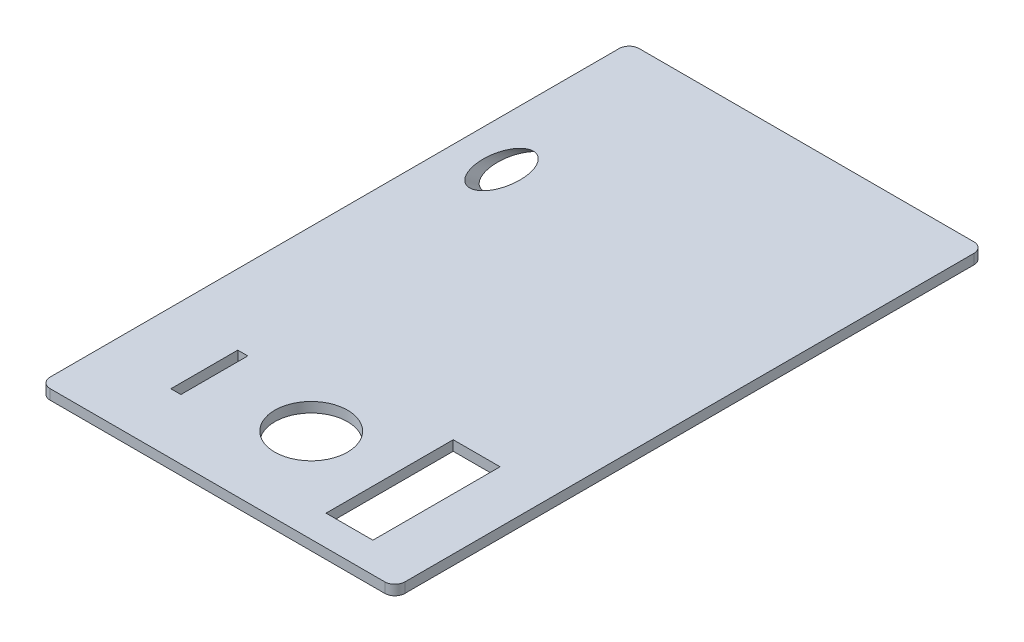
ISO-10303-21;
HEADER;
FILE_DESCRIPTION(('STEP AP214'),'2;1');
FILE_NAME('part.step','',(''),(''),'','','');
FILE_SCHEMA(('AUTOMOTIVE_DESIGN { 1 0 10303 214 1 1 1 1 }'));
ENDSEC;
DATA;
#1=APPLICATION_CONTEXT('core data for automotive mechanical design processes');
#2=APPLICATION_PROTOCOL_DEFINITION('international standard','automotive_design',2000,#1);
#3=PRODUCT_CONTEXT('',#1,'mechanical');
#4=PRODUCT('Part','Part','',(#3));
#5=PRODUCT_RELATED_PRODUCT_CATEGORY('part','',(#4));
#6=PRODUCT_DEFINITION_FORMATION('','',#4);
#7=PRODUCT_DEFINITION_CONTEXT('part definition',#1,'design');
#8=PRODUCT_DEFINITION('design','',#6,#7);
#9=PRODUCT_DEFINITION_SHAPE('','',#8);
#10=(LENGTH_UNIT() NAMED_UNIT(*) SI_UNIT(.MILLI.,.METRE.));
#11=(NAMED_UNIT(*) PLANE_ANGLE_UNIT() SI_UNIT($,.RADIAN.));
#12=(NAMED_UNIT(*) SI_UNIT($,.STERADIAN.) SOLID_ANGLE_UNIT());
#13=UNCERTAINTY_MEASURE_WITH_UNIT(LENGTH_MEASURE(1.E-05),#10,'distance_accuracy_value','');
#14=(GEOMETRIC_REPRESENTATION_CONTEXT(3) GLOBAL_UNCERTAINTY_ASSIGNED_CONTEXT((#13)) GLOBAL_UNIT_ASSIGNED_CONTEXT((#10,
#11,#12)) REPRESENTATION_CONTEXT('',''));
#15=CARTESIAN_POINT('',(0.,0.,0.));
#16=DIRECTION('',(0.,0.,1.));
#17=DIRECTION('',(1.,0.,0.));
#18=AXIS2_PLACEMENT_3D('',#15,#16,#17);
#19=CARTESIAN_POINT('',(53.,70.,88.));
#20=DIRECTION('',(0.,0.,-1.));
#21=DIRECTION('',(-1.,0.,0.));
#22=AXIS2_PLACEMENT_3D('',#19,#20,#21);
#23=PLANE('',#22);
#24=DIRECTION('',(1.,0.,0.));
#25=VECTOR('',#24,1.);
#26=CARTESIAN_POINT('',(50.,0.,88.));
#27=LINE('',#26,#25);
#28=CARTESIAN_POINT('',(-50.,0.,88.));
#29=VERTEX_POINT('',#28);
#30=CARTESIAN_POINT('',(50.,0.,88.));
#31=VERTEX_POINT('',#30);
#32=EDGE_CURVE('E347',#29,#31,#27,.T.);
#33=ORIENTED_EDGE('',*,*,#32,.F.);
#34=DIRECTION('',(0.,1.,0.));
#35=VECTOR('',#34,1.);
#36=CARTESIAN_POINT('',(-50.,70.,88.));
#37=LINE('',#36,#35);
#38=CARTESIAN_POINT('',(-50.,-3.,88.));
#39=VERTEX_POINT('',#38);
#40=EDGE_CURVE('E188',#29,#39,#37,.F.);
#41=ORIENTED_EDGE('',*,*,#40,.T.);
#42=DIRECTION('',(-1.,0.,0.));
#43=VECTOR('',#42,1.);
#44=CARTESIAN_POINT('',(53.,-3.,88.));
#45=LINE('',#44,#43);
#46=CARTESIAN_POINT('',(50.,-3.,88.));
#47=VERTEX_POINT('',#46);
#48=EDGE_CURVE('E234',#47,#39,#45,.T.);
#49=ORIENTED_EDGE('',*,*,#48,.F.);
#50=DIRECTION('',(0.,1.,0.));
#51=VECTOR('',#50,1.);
#52=CARTESIAN_POINT('',(50.,70.,88.));
#53=LINE('',#52,#51);
#54=EDGE_CURVE('E181',#47,#31,#53,.T.);
#55=ORIENTED_EDGE('',*,*,#54,.T.);
#56=EDGE_LOOP('',(#33,#41,#49,#55));
#57=FACE_BOUND('',#56,.T.);
#58=ADVANCED_FACE('F38',(#57),#23,.F.);
#59=CARTESIAN_POINT('',(53.,70.,-88.));
#60=DIRECTION('',(0.,0.,1.));
#61=DIRECTION('',(1.,0.,0.));
#62=AXIS2_PLACEMENT_3D('',#59,#60,#61);
#63=PLANE('',#62);
#64=DIRECTION('',(-1.,0.,0.));
#65=VECTOR('',#64,1.);
#66=CARTESIAN_POINT('',(50.,0.,-88.));
#67=LINE('',#66,#65);
#68=CARTESIAN_POINT('',(50.,0.,-88.));
#69=VERTEX_POINT('',#68);
#70=CARTESIAN_POINT('',(-50.,0.,-88.));
#71=VERTEX_POINT('',#70);
#72=EDGE_CURVE('E344',#69,#71,#67,.T.);
#73=ORIENTED_EDGE('',*,*,#72,.F.);
#74=DIRECTION('',(0.,1.,0.));
#75=VECTOR('',#74,1.);
#76=CARTESIAN_POINT('',(50.,70.,-88.));
#77=LINE('',#76,#75);
#78=CARTESIAN_POINT('',(50.,-3.,-88.));
#79=VERTEX_POINT('',#78);
#80=EDGE_CURVE('E171',#69,#79,#77,.F.);
#81=ORIENTED_EDGE('',*,*,#80,.T.);
#82=DIRECTION('',(1.,0.,0.));
#83=VECTOR('',#82,1.);
#84=CARTESIAN_POINT('',(53.,-3.,-88.));
#85=LINE('',#84,#83);
#86=CARTESIAN_POINT('',(-50.,-3.,-88.));
#87=VERTEX_POINT('',#86);
#88=EDGE_CURVE('E240',#87,#79,#85,.T.);
#89=ORIENTED_EDGE('',*,*,#88,.F.);
#90=DIRECTION('',(0.,1.,0.));
#91=VECTOR('',#90,1.);
#92=CARTESIAN_POINT('',(-50.,70.,-88.));
#93=LINE('',#92,#91);
#94=EDGE_CURVE('E203',#87,#71,#93,.T.);
#95=ORIENTED_EDGE('',*,*,#94,.T.);
#96=EDGE_LOOP('',(#73,#81,#89,#95));
#97=FACE_BOUND('',#96,.T.);
#98=ADVANCED_FACE('F361',(#97),#63,.F.);
#99=CARTESIAN_POINT('',(-53.,70.,-88.));
#100=DIRECTION('',(1.,0.,0.));
#101=DIRECTION('',(0.,0.,-1.));
#102=AXIS2_PLACEMENT_3D('',#99,#100,#101);
#103=PLANE('',#102);
#104=DIRECTION('',(0.,1.,0.));
#105=VECTOR('',#104,1.);
#106=CARTESIAN_POINT('',(-53.,70.,85.));
#107=LINE('',#106,#105);
#108=CARTESIAN_POINT('',(-53.,-3.,85.));
#109=VERTEX_POINT('',#108);
#110=CARTESIAN_POINT('',(-53.,0.,85.));
#111=VERTEX_POINT('',#110);
#112=EDGE_CURVE('E48',#109,#111,#107,.T.);
#113=ORIENTED_EDGE('',*,*,#112,.T.);
#114=DIRECTION('',(0.,0.,1.));
#115=VECTOR('',#114,1.);
#116=CARTESIAN_POINT('',(-53.,0.,-85.));
#117=LINE('',#116,#115);
#118=CARTESIAN_POINT('',(-53.,0.,-85.));
#119=VERTEX_POINT('',#118);
#120=EDGE_CURVE('E163',#119,#111,#117,.T.);
#121=ORIENTED_EDGE('',*,*,#120,.F.);
#122=DIRECTION('',(0.,1.,0.));
#123=VECTOR('',#122,1.);
#124=CARTESIAN_POINT('',(-53.,70.,-85.));
#125=LINE('',#124,#123);
#126=CARTESIAN_POINT('',(-53.,-3.,-85.));
#127=VERTEX_POINT('',#126);
#128=EDGE_CURVE('E11',#119,#127,#125,.F.);
#129=ORIENTED_EDGE('',*,*,#128,.T.);
#130=DIRECTION('',(0.,0.,-1.));
#131=VECTOR('',#130,1.);
#132=CARTESIAN_POINT('',(-53.,-3.,88.));
#133=LINE('',#132,#131);
#134=EDGE_CURVE('E218',#109,#127,#133,.T.);
#135=ORIENTED_EDGE('',*,*,#134,.F.);
#136=EDGE_LOOP('',(#113,#121,#129,#135));
#137=FACE_BOUND('',#136,.T.);
#138=ADVANCED_FACE('F215',(#137),#103,.F.);
#139=CARTESIAN_POINT('',(53.,70.,-88.));
#140=DIRECTION('',(-1.,0.,0.));
#141=DIRECTION('',(0.,0.,1.));
#142=AXIS2_PLACEMENT_3D('',#139,#140,#141);
#143=PLANE('',#142);
#144=DIRECTION('',(0.,1.,0.));
#145=VECTOR('',#144,1.);
#146=CARTESIAN_POINT('',(53.,70.,-85.));
#147=LINE('',#146,#145);
#148=CARTESIAN_POINT('',(53.,-3.,-85.));
#149=VERTEX_POINT('',#148);
#150=CARTESIAN_POINT('',(53.,0.,-85.));
#151=VERTEX_POINT('',#150);
#152=EDGE_CURVE('E170',#149,#151,#147,.T.);
#153=ORIENTED_EDGE('',*,*,#152,.T.);
#154=DIRECTION('',(0.,0.,-1.));
#155=VECTOR('',#154,1.);
#156=CARTESIAN_POINT('',(53.,0.,-85.));
#157=LINE('',#156,#155);
#158=CARTESIAN_POINT('',(53.,0.,85.));
#159=VERTEX_POINT('',#158);
#160=EDGE_CURVE('E151',#159,#151,#157,.T.);
#161=ORIENTED_EDGE('',*,*,#160,.F.);
#162=DIRECTION('',(0.,1.,0.));
#163=VECTOR('',#162,1.);
#164=CARTESIAN_POINT('',(53.,70.,85.));
#165=LINE('',#164,#163);
#166=CARTESIAN_POINT('',(53.,-3.,85.));
#167=VERTEX_POINT('',#166);
#168=EDGE_CURVE('E180',#159,#167,#165,.F.);
#169=ORIENTED_EDGE('',*,*,#168,.T.);
#170=DIRECTION('',(0.,0.,1.));
#171=VECTOR('',#170,1.);
#172=CARTESIAN_POINT('',(53.,-3.,88.));
#173=LINE('',#172,#171);
#174=EDGE_CURVE('E178',#149,#167,#173,.T.);
#175=ORIENTED_EDGE('',*,*,#174,.F.);
#176=EDGE_LOOP('',(#153,#161,#169,#175));
#177=FACE_BOUND('',#176,.T.);
#178=ADVANCED_FACE('F176',(#177),#143,.F.);
#179=CARTESIAN_POINT('',(0.,0.,0.));
#180=DIRECTION('',(0.,1.,0.));
#181=DIRECTION('',(0.,0.,1.));
#182=AXIS2_PLACEMENT_3D('',#179,#180,#181);
#183=PLANE('',#182);
#184=CARTESIAN_POINT('',(-50.,0.,-85.));
#185=DIRECTION('',(0.,-1.,0.));
#186=DIRECTION('',(0.,0.,-1.));
#187=AXIS2_PLACEMENT_3D('',#184,#185,#186);
#188=CIRCLE('',#187,3.);
#189=EDGE_CURVE('E173',#119,#71,#188,.T.);
#190=ORIENTED_EDGE('',*,*,#189,.F.);
#191=ORIENTED_EDGE('',*,*,#120,.T.);
#192=CARTESIAN_POINT('',(-50.,0.,85.));
#193=DIRECTION('',(0.,-1.,0.));
#194=DIRECTION('',(0.,0.,-1.));
#195=AXIS2_PLACEMENT_3D('',#192,#193,#194);
#196=CIRCLE('',#195,3.);
#197=EDGE_CURVE('E223',#29,#111,#196,.T.);
#198=ORIENTED_EDGE('',*,*,#197,.F.);
#199=ORIENTED_EDGE('',*,*,#32,.T.);
#200=CARTESIAN_POINT('',(50.,0.,85.));
#201=DIRECTION('',(0.,-1.,0.));
#202=DIRECTION('',(0.,0.,-1.));
#203=AXIS2_PLACEMENT_3D('',#200,#201,#202);
#204=CIRCLE('',#203,3.);
#205=EDGE_CURVE('E158',#159,#31,#204,.T.);
#206=ORIENTED_EDGE('',*,*,#205,.F.);
#207=ORIENTED_EDGE('',*,*,#160,.T.);
#208=CARTESIAN_POINT('',(50.,0.,-85.));
#209=DIRECTION('',(0.,-1.,0.));
#210=DIRECTION('',(0.,0.,-1.));
#211=AXIS2_PLACEMENT_3D('',#208,#209,#210);
#212=CIRCLE('',#211,3.);
#213=EDGE_CURVE('E155',#69,#151,#212,.T.);
#214=ORIENTED_EDGE('',*,*,#213,.F.);
#215=ORIENTED_EDGE('',*,*,#72,.T.);
#216=EDGE_LOOP('',(#190,#191,#198,#199,#206,#207,#214,#215));
#217=FACE_BOUND('',#216,.T.);
#218=CARTESIAN_POINT('',(-39.2636636390506,0.,-36.1311043412954));
#219=DIRECTION('',(0.,1.,0.));
#220=DIRECTION('',(0.,0.,1.));
#221=AXIS2_PLACEMENT_3D('',#218,#219,#220);
#222=ELLIPSE('',#221,9.52340377640063,5.46239999999998);
#223=CARTESIAN_POINT('',(-39.2636636390506,0.,-26.6077005648948));
#224=VERTEX_POINT('',#223);
#225=EDGE_CURVE('E42',#224,#224,#222,.T.);
#226=ORIENTED_EDGE('',*,*,#225,.F.);
#227=EDGE_LOOP('',(#226));
#228=FACE_BOUND('',#227,.T.);
#229=DIRECTION('',(0.,0.,1.));
#230=VECTOR('',#229,1.);
#231=CARTESIAN_POINT('',(-31.9347532475003,0.,50.));
#232=LINE('',#231,#230);
#233=CARTESIAN_POINT('',(-31.9347532475003,0.,50.));
#234=VERTEX_POINT('',#233);
#235=CARTESIAN_POINT('',(-31.9347532475003,0.,70.));
#236=VERTEX_POINT('',#235);
#237=EDGE_CURVE('E55',#234,#236,#232,.T.);
#238=ORIENTED_EDGE('',*,*,#237,.F.);
#239=DIRECTION('',(-1.,0.,0.));
#240=VECTOR('',#239,1.);
#241=CARTESIAN_POINT('',(-28.9347532475003,0.,50.));
#242=LINE('',#241,#240);
#243=CARTESIAN_POINT('',(-28.9347532475003,0.,50.));
#244=VERTEX_POINT('',#243);
#245=EDGE_CURVE('E311',#244,#234,#242,.T.);
#246=ORIENTED_EDGE('',*,*,#245,.F.);
#247=DIRECTION('',(0.,0.,-1.));
#248=VECTOR('',#247,1.);
#249=CARTESIAN_POINT('',(-28.9347532475003,0.,50.));
#250=LINE('',#249,#248);
#251=CARTESIAN_POINT('',(-28.9347532475003,0.,70.));
#252=VERTEX_POINT('',#251);
#253=EDGE_CURVE('E316',#252,#244,#250,.T.);
#254=ORIENTED_EDGE('',*,*,#253,.F.);
#255=DIRECTION('',(1.,0.,0.));
#256=VECTOR('',#255,1.);
#257=CARTESIAN_POINT('',(-28.9347532475003,0.,70.));
#258=LINE('',#257,#256);
#259=EDGE_CURVE('E320',#236,#252,#258,.T.);
#260=ORIENTED_EDGE('',*,*,#259,.F.);
#261=EDGE_LOOP('',(#238,#246,#254,#260));
#262=FACE_BOUND('',#261,.T.);
#263=DIRECTION('',(0.,0.,-1.));
#264=VECTOR('',#263,1.);
#265=CARTESIAN_POINT('',(37.4347532475004,0.,41.));
#266=LINE('',#265,#264);
#267=CARTESIAN_POINT('',(37.4347532475004,0.,79.));
#268=VERTEX_POINT('',#267);
#269=CARTESIAN_POINT('',(37.4347532475004,0.,41.));
#270=VERTEX_POINT('',#269);
#271=EDGE_CURVE('E281',#268,#270,#266,.T.);
#272=ORIENTED_EDGE('',*,*,#271,.F.);
#273=DIRECTION('',(1.,0.,0.));
#274=VECTOR('',#273,1.);
#275=CARTESIAN_POINT('',(23.4347532475004,0.,79.));
#276=LINE('',#275,#274);
#277=CARTESIAN_POINT('',(23.4347532475004,0.,79.));
#278=VERTEX_POINT('',#277);
#279=EDGE_CURVE('E268',#278,#268,#276,.T.);
#280=ORIENTED_EDGE('',*,*,#279,.F.);
#281=DIRECTION('',(0.,0.,1.));
#282=VECTOR('',#281,1.);
#283=CARTESIAN_POINT('',(23.4347532475004,0.,41.));
#284=LINE('',#283,#282);
#285=CARTESIAN_POINT('',(23.4347532475004,0.,41.));
#286=VERTEX_POINT('',#285);
#287=EDGE_CURVE('E273',#286,#278,#284,.T.);
#288=ORIENTED_EDGE('',*,*,#287,.F.);
#289=DIRECTION('',(-1.,0.,0.));
#290=VECTOR('',#289,1.);
#291=CARTESIAN_POINT('',(23.4347532475004,0.,41.));
#292=LINE('',#291,#290);
#293=EDGE_CURVE('E277',#270,#286,#292,.T.);
#294=ORIENTED_EDGE('',*,*,#293,.F.);
#295=EDGE_LOOP('',(#272,#280,#288,#294));
#296=FACE_BOUND('',#295,.T.);
#297=CARTESIAN_POINT('',(0.,0.,60.));
#298=DIRECTION('',(0.,1.,0.));
#299=DIRECTION('',(0.,0.,1.));
#300=AXIS2_PLACEMENT_3D('',#297,#298,#299);
#301=CIRCLE('',#300,10.8695064950007);
#302=CARTESIAN_POINT('',(0.,0.,70.8695064950007));
#303=VERTEX_POINT('',#302);
#304=EDGE_CURVE('E247',#303,#303,#301,.T.);
#305=ORIENTED_EDGE('',*,*,#304,.F.);
#306=EDGE_LOOP('',(#305));
#307=FACE_BOUND('',#306,.T.);
#308=ADVANCED_FACE('F153',(#217,#228,#262,#296,#307),#183,.T.);
#309=CARTESIAN_POINT('',(0.,-3.,0.));
#310=DIRECTION('',(0.,1.,0.));
#311=DIRECTION('',(0.,0.,1.));
#312=AXIS2_PLACEMENT_3D('',#309,#310,#311);
#313=PLANE('',#312);
#314=CARTESIAN_POINT('',(-39.2636636390506,-3.,-40.4155483615218));
#315=DIRECTION('',(0.,1.,0.));
#316=DIRECTION('',(0.,0.,1.));
#317=AXIS2_PLACEMENT_3D('',#314,#315,#316);
#318=ELLIPSE('',#317,9.52340377640063,5.46239999999998);
#319=CARTESIAN_POINT('',(-39.2636636390506,-3.,-30.8921445851211));
#320=VERTEX_POINT('',#319);
#321=EDGE_CURVE('E326',#320,#320,#318,.T.);
#322=ORIENTED_EDGE('',*,*,#321,.T.);
#323=EDGE_LOOP('',(#322));
#324=FACE_BOUND('',#323,.T.);
#325=DIRECTION('',(-1.,0.,0.));
#326=VECTOR('',#325,1.);
#327=CARTESIAN_POINT('',(-28.9347532475003,-3.,50.));
#328=LINE('',#327,#326);
#329=CARTESIAN_POINT('',(-28.9347532475003,-3.,50.));
#330=VERTEX_POINT('',#329);
#331=CARTESIAN_POINT('',(-31.9347532475003,-3.,50.));
#332=VERTEX_POINT('',#331);
#333=EDGE_CURVE('E303',#330,#332,#328,.T.);
#334=ORIENTED_EDGE('',*,*,#333,.T.);
#335=DIRECTION('',(0.,0.,1.));
#336=VECTOR('',#335,1.);
#337=CARTESIAN_POINT('',(-31.9347532475003,-3.,50.));
#338=LINE('',#337,#336);
#339=CARTESIAN_POINT('',(-31.9347532475003,-3.,70.));
#340=VERTEX_POINT('',#339);
#341=EDGE_CURVE('E315',#332,#340,#338,.T.);
#342=ORIENTED_EDGE('',*,*,#341,.T.);
#343=DIRECTION('',(1.,0.,0.));
#344=VECTOR('',#343,1.);
#345=CARTESIAN_POINT('',(-28.9347532475003,-3.,70.));
#346=LINE('',#345,#344);
#347=CARTESIAN_POINT('',(-28.9347532475003,-3.,70.));
#348=VERTEX_POINT('',#347);
#349=EDGE_CURVE('E332',#340,#348,#346,.T.);
#350=ORIENTED_EDGE('',*,*,#349,.T.);
#351=DIRECTION('',(0.,0.,-1.));
#352=VECTOR('',#351,1.);
#353=CARTESIAN_POINT('',(-28.9347532475003,-3.,50.));
#354=LINE('',#353,#352);
#355=EDGE_CURVE('E63',#348,#330,#354,.T.);
#356=ORIENTED_EDGE('',*,*,#355,.T.);
#357=EDGE_LOOP('',(#334,#342,#350,#356));
#358=FACE_BOUND('',#357,.T.);
#359=DIRECTION('',(1.,0.,0.));
#360=VECTOR('',#359,1.);
#361=CARTESIAN_POINT('',(23.4347532475004,-3.,79.));
#362=LINE('',#361,#360);
#363=CARTESIAN_POINT('',(23.4347532475004,-3.,79.));
#364=VERTEX_POINT('',#363);
#365=CARTESIAN_POINT('',(37.4347532475004,-3.,79.));
#366=VERTEX_POINT('',#365);
#367=EDGE_CURVE('E260',#364,#366,#362,.T.);
#368=ORIENTED_EDGE('',*,*,#367,.T.);
#369=DIRECTION('',(0.,0.,-1.));
#370=VECTOR('',#369,1.);
#371=CARTESIAN_POINT('',(37.4347532475004,-3.,41.));
#372=LINE('',#371,#370);
#373=CARTESIAN_POINT('',(37.4347532475004,-3.,41.));
#374=VERTEX_POINT('',#373);
#375=EDGE_CURVE('E272',#366,#374,#372,.T.);
#376=ORIENTED_EDGE('',*,*,#375,.T.);
#377=DIRECTION('',(-1.,0.,0.));
#378=VECTOR('',#377,1.);
#379=CARTESIAN_POINT('',(23.4347532475004,-3.,41.));
#380=LINE('',#379,#378);
#381=CARTESIAN_POINT('',(23.4347532475004,-3.,41.));
#382=VERTEX_POINT('',#381);
#383=EDGE_CURVE('E292',#374,#382,#380,.T.);
#384=ORIENTED_EDGE('',*,*,#383,.T.);
#385=DIRECTION('',(0.,0.,1.));
#386=VECTOR('',#385,1.);
#387=CARTESIAN_POINT('',(23.4347532475004,-3.,41.));
#388=LINE('',#387,#386);
#389=EDGE_CURVE('E288',#382,#364,#388,.T.);
#390=ORIENTED_EDGE('',*,*,#389,.T.);
#391=EDGE_LOOP('',(#368,#376,#384,#390));
#392=FACE_BOUND('',#391,.T.);
#393=CARTESIAN_POINT('',(0.,-3.,60.));
#394=DIRECTION('',(0.,1.,0.));
#395=DIRECTION('',(0.,0.,1.));
#396=AXIS2_PLACEMENT_3D('',#393,#394,#395);
#397=CIRCLE('',#396,10.8695064950007);
#398=CARTESIAN_POINT('',(0.,-3.,70.8695064950007));
#399=VERTEX_POINT('',#398);
#400=EDGE_CURVE('E246',#399,#399,#397,.T.);
#401=ORIENTED_EDGE('',*,*,#400,.T.);
#402=EDGE_LOOP('',(#401));
#403=FACE_BOUND('',#402,.T.);
#404=ORIENTED_EDGE('',*,*,#174,.T.);
#405=CARTESIAN_POINT('',(50.,-3.,85.));
#406=DIRECTION('',(0.,1.,0.));
#407=DIRECTION('',(0.,0.,1.));
#408=AXIS2_PLACEMENT_3D('',#405,#406,#407);
#409=CIRCLE('',#408,3.);
#410=EDGE_CURVE('E200',#167,#47,#409,.F.);
#411=ORIENTED_EDGE('',*,*,#410,.T.);
#412=ORIENTED_EDGE('',*,*,#48,.T.);
#413=CARTESIAN_POINT('',(-50.,-3.,85.));
#414=DIRECTION('',(0.,1.,0.));
#415=DIRECTION('',(0.,0.,1.));
#416=AXIS2_PLACEMENT_3D('',#413,#414,#415);
#417=CIRCLE('',#416,3.);
#418=EDGE_CURVE('E185',#39,#109,#417,.F.);
#419=ORIENTED_EDGE('',*,*,#418,.T.);
#420=ORIENTED_EDGE('',*,*,#134,.T.);
#421=CARTESIAN_POINT('',(-50.,-3.,-85.));
#422=DIRECTION('',(0.,1.,0.));
#423=DIRECTION('',(0.,0.,1.));
#424=AXIS2_PLACEMENT_3D('',#421,#422,#423);
#425=CIRCLE('',#424,3.);
#426=EDGE_CURVE('E194',#127,#87,#425,.F.);
#427=ORIENTED_EDGE('',*,*,#426,.T.);
#428=ORIENTED_EDGE('',*,*,#88,.T.);
#429=CARTESIAN_POINT('',(50.,-3.,-85.));
#430=DIRECTION('',(0.,1.,0.));
#431=DIRECTION('',(0.,0.,1.));
#432=AXIS2_PLACEMENT_3D('',#429,#430,#431);
#433=CIRCLE('',#432,3.);
#434=EDGE_CURVE('E197',#79,#149,#433,.F.);
#435=ORIENTED_EDGE('',*,*,#434,.T.);
#436=EDGE_LOOP('',(#404,#411,#412,#419,#420,#427,#428,#435));
#437=FACE_BOUND('',#436,.T.);
#438=ADVANCED_FACE('F356',(#324,#358,#392,#403,#437),#313,.F.);
#439=CARTESIAN_POINT('',(50.,70.,85.));
#440=DIRECTION('',(0.,1.,0.));
#441=DIRECTION('',(0.,0.,1.));
#442=AXIS2_PLACEMENT_3D('',#439,#440,#441);
#443=CYLINDRICAL_SURFACE('',#442,3.);
#444=ORIENTED_EDGE('',*,*,#410,.F.);
#445=ORIENTED_EDGE('',*,*,#168,.F.);
#446=ORIENTED_EDGE('',*,*,#205,.T.);
#447=ORIENTED_EDGE('',*,*,#54,.F.);
#448=EDGE_LOOP('',(#444,#445,#446,#447));
#449=FACE_BOUND('',#448,.T.);
#450=ADVANCED_FACE('F353',(#449),#443,.T.);
#451=CARTESIAN_POINT('',(50.,70.,-85.));
#452=DIRECTION('',(0.,1.,0.));
#453=DIRECTION('',(0.,0.,1.));
#454=AXIS2_PLACEMENT_3D('',#451,#452,#453);
#455=CYLINDRICAL_SURFACE('',#454,3.);
#456=ORIENTED_EDGE('',*,*,#434,.F.);
#457=ORIENTED_EDGE('',*,*,#80,.F.);
#458=ORIENTED_EDGE('',*,*,#213,.T.);
#459=ORIENTED_EDGE('',*,*,#152,.F.);
#460=EDGE_LOOP('',(#456,#457,#458,#459));
#461=FACE_BOUND('',#460,.T.);
#462=ADVANCED_FACE('F169',(#461),#455,.T.);
#463=CARTESIAN_POINT('',(-50.,70.,-85.));
#464=DIRECTION('',(0.,1.,0.));
#465=DIRECTION('',(0.,0.,1.));
#466=AXIS2_PLACEMENT_3D('',#463,#464,#465);
#467=CYLINDRICAL_SURFACE('',#466,3.);
#468=ORIENTED_EDGE('',*,*,#426,.F.);
#469=ORIENTED_EDGE('',*,*,#128,.F.);
#470=ORIENTED_EDGE('',*,*,#189,.T.);
#471=ORIENTED_EDGE('',*,*,#94,.F.);
#472=EDGE_LOOP('',(#468,#469,#470,#471));
#473=FACE_BOUND('',#472,.T.);
#474=ADVANCED_FACE('F363',(#473),#467,.T.);
#475=CARTESIAN_POINT('',(-50.,70.,85.));
#476=DIRECTION('',(0.,1.,0.));
#477=DIRECTION('',(0.,0.,1.));
#478=AXIS2_PLACEMENT_3D('',#475,#476,#477);
#479=CYLINDRICAL_SURFACE('',#478,3.);
#480=ORIENTED_EDGE('',*,*,#418,.F.);
#481=ORIENTED_EDGE('',*,*,#40,.F.);
#482=ORIENTED_EDGE('',*,*,#197,.T.);
#483=ORIENTED_EDGE('',*,*,#112,.F.);
#484=EDGE_LOOP('',(#480,#481,#482,#483));
#485=FACE_BOUND('',#484,.T.);
#486=ADVANCED_FACE('F40',(#485),#479,.T.);
#487=CARTESIAN_POINT('',(0.,-3.,60.));
#488=DIRECTION('',(0.,1.,0.));
#489=DIRECTION('',(0.,0.,1.));
#490=AXIS2_PLACEMENT_3D('',#487,#488,#489);
#491=CYLINDRICAL_SURFACE('',#490,10.8695064950007);
#492=ORIENTED_EDGE('',*,*,#400,.F.);
#493=EDGE_LOOP('',(#492));
#494=FACE_BOUND('',#493,.T.);
#495=ORIENTED_EDGE('',*,*,#304,.T.);
#496=EDGE_LOOP('',(#495));
#497=FACE_BOUND('',#496,.T.);
#498=ADVANCED_FACE('F369',(#494,#497),#491,.F.);
#499=CARTESIAN_POINT('',(37.4347532475004,-3.,41.));
#500=DIRECTION('',(1.,0.,0.));
#501=DIRECTION('',(0.,0.,-1.));
#502=AXIS2_PLACEMENT_3D('',#499,#500,#501);
#503=PLANE('',#502);
#504=ORIENTED_EDGE('',*,*,#271,.T.);
#505=DIRECTION('',(0.,1.,0.));
#506=VECTOR('',#505,1.);
#507=CARTESIAN_POINT('',(37.4347532475004,-3.,41.));
#508=LINE('',#507,#506);
#509=EDGE_CURVE('E255',#374,#270,#508,.T.);
#510=ORIENTED_EDGE('',*,*,#509,.F.);
#511=ORIENTED_EDGE('',*,*,#375,.F.);
#512=DIRECTION('',(0.,1.,0.));
#513=VECTOR('',#512,1.);
#514=CARTESIAN_POINT('',(37.4347532475004,-3.,79.));
#515=LINE('',#514,#513);
#516=EDGE_CURVE('E251',#366,#268,#515,.T.);
#517=ORIENTED_EDGE('',*,*,#516,.T.);
#518=EDGE_LOOP('',(#504,#510,#511,#517));
#519=FACE_BOUND('',#518,.T.);
#520=ADVANCED_FACE('F398',(#519),#503,.F.);
#521=CARTESIAN_POINT('',(23.4347532475004,-3.,79.));
#522=DIRECTION('',(0.,0.,1.));
#523=DIRECTION('',(1.,0.,0.));
#524=AXIS2_PLACEMENT_3D('',#521,#522,#523);
#525=PLANE('',#524);
#526=ORIENTED_EDGE('',*,*,#279,.T.);
#527=ORIENTED_EDGE('',*,*,#516,.F.);
#528=ORIENTED_EDGE('',*,*,#367,.F.);
#529=DIRECTION('',(0.,1.,0.));
#530=VECTOR('',#529,1.);
#531=CARTESIAN_POINT('',(23.4347532475004,-3.,79.));
#532=LINE('',#531,#530);
#533=EDGE_CURVE('E263',#364,#278,#532,.T.);
#534=ORIENTED_EDGE('',*,*,#533,.T.);
#535=EDGE_LOOP('',(#526,#527,#528,#534));
#536=FACE_BOUND('',#535,.T.);
#537=ADVANCED_FACE('F402',(#536),#525,.F.);
#538=CARTESIAN_POINT('',(23.4347532475004,-3.,41.));
#539=DIRECTION('',(-1.,0.,0.));
#540=DIRECTION('',(0.,0.,1.));
#541=AXIS2_PLACEMENT_3D('',#538,#539,#540);
#542=PLANE('',#541);
#543=ORIENTED_EDGE('',*,*,#287,.T.);
#544=ORIENTED_EDGE('',*,*,#533,.F.);
#545=ORIENTED_EDGE('',*,*,#389,.F.);
#546=DIRECTION('',(0.,1.,0.));
#547=VECTOR('',#546,1.);
#548=CARTESIAN_POINT('',(23.4347532475004,-3.,41.));
#549=LINE('',#548,#547);
#550=EDGE_CURVE('E259',#382,#286,#549,.T.);
#551=ORIENTED_EDGE('',*,*,#550,.T.);
#552=EDGE_LOOP('',(#543,#544,#545,#551));
#553=FACE_BOUND('',#552,.T.);
#554=ADVANCED_FACE('F408',(#553),#542,.F.);
#555=CARTESIAN_POINT('',(23.4347532475004,-3.,41.));
#556=DIRECTION('',(0.,0.,-1.));
#557=DIRECTION('',(-1.,0.,0.));
#558=AXIS2_PLACEMENT_3D('',#555,#556,#557);
#559=PLANE('',#558);
#560=ORIENTED_EDGE('',*,*,#293,.T.);
#561=ORIENTED_EDGE('',*,*,#550,.F.);
#562=ORIENTED_EDGE('',*,*,#383,.F.);
#563=ORIENTED_EDGE('',*,*,#509,.T.);
#564=EDGE_LOOP('',(#560,#561,#562,#563));
#565=FACE_BOUND('',#564,.T.);
#566=ADVANCED_FACE('F404',(#565),#559,.F.);
#567=CARTESIAN_POINT('',(-31.9347532475003,-3.,50.));
#568=DIRECTION('',(-1.,0.,0.));
#569=DIRECTION('',(0.,0.,1.));
#570=AXIS2_PLACEMENT_3D('',#567,#568,#569);
#571=PLANE('',#570);
#572=ORIENTED_EDGE('',*,*,#237,.T.);
#573=DIRECTION('',(0.,1.,0.));
#574=VECTOR('',#573,1.);
#575=CARTESIAN_POINT('',(-31.9347532475003,-3.,70.));
#576=LINE('',#575,#574);
#577=EDGE_CURVE('E299',#340,#236,#576,.T.);
#578=ORIENTED_EDGE('',*,*,#577,.F.);
#579=ORIENTED_EDGE('',*,*,#341,.F.);
#580=DIRECTION('',(0.,1.,0.));
#581=VECTOR('',#580,1.);
#582=CARTESIAN_POINT('',(-31.9347532475003,-3.,50.));
#583=LINE('',#582,#581);
#584=EDGE_CURVE('E284',#332,#234,#583,.T.);
#585=ORIENTED_EDGE('',*,*,#584,.T.);
#586=EDGE_LOOP('',(#572,#578,#579,#585));
#587=FACE_BOUND('',#586,.T.);
#588=ADVANCED_FACE('F407',(#587),#571,.F.);
#589=CARTESIAN_POINT('',(-28.9347532475003,-3.,50.));
#590=DIRECTION('',(0.,0.,-1.));
#591=DIRECTION('',(-1.,0.,0.));
#592=AXIS2_PLACEMENT_3D('',#589,#590,#591);
#593=PLANE('',#592);
#594=ORIENTED_EDGE('',*,*,#245,.T.);
#595=ORIENTED_EDGE('',*,*,#584,.F.);
#596=ORIENTED_EDGE('',*,*,#333,.F.);
#597=DIRECTION('',(0.,1.,0.));
#598=VECTOR('',#597,1.);
#599=CARTESIAN_POINT('',(-28.9347532475003,-3.,50.));
#600=LINE('',#599,#598);
#601=EDGE_CURVE('E306',#330,#244,#600,.T.);
#602=ORIENTED_EDGE('',*,*,#601,.T.);
#603=EDGE_LOOP('',(#594,#595,#596,#602));
#604=FACE_BOUND('',#603,.T.);
#605=ADVANCED_FACE('F418',(#604),#593,.F.);
#606=CARTESIAN_POINT('',(-28.9347532475003,-3.,50.));
#607=DIRECTION('',(1.,0.,0.));
#608=DIRECTION('',(0.,0.,-1.));
#609=AXIS2_PLACEMENT_3D('',#606,#607,#608);
#610=PLANE('',#609);
#611=ORIENTED_EDGE('',*,*,#253,.T.);
#612=ORIENTED_EDGE('',*,*,#601,.F.);
#613=ORIENTED_EDGE('',*,*,#355,.F.);
#614=DIRECTION('',(0.,1.,0.));
#615=VECTOR('',#614,1.);
#616=CARTESIAN_POINT('',(-28.9347532475003,-3.,70.));
#617=LINE('',#616,#615);
#618=EDGE_CURVE('E302',#348,#252,#617,.T.);
#619=ORIENTED_EDGE('',*,*,#618,.T.);
#620=EDGE_LOOP('',(#611,#612,#613,#619));
#621=FACE_BOUND('',#620,.T.);
#622=ADVANCED_FACE('F423',(#621),#610,.F.);
#623=CARTESIAN_POINT('',(-28.9347532475003,-3.,70.));
#624=DIRECTION('',(0.,0.,1.));
#625=DIRECTION('',(1.,0.,0.));
#626=AXIS2_PLACEMENT_3D('',#623,#624,#625);
#627=PLANE('',#626);
#628=ORIENTED_EDGE('',*,*,#259,.T.);
#629=ORIENTED_EDGE('',*,*,#618,.F.);
#630=ORIENTED_EDGE('',*,*,#349,.F.);
#631=ORIENTED_EDGE('',*,*,#577,.T.);
#632=EDGE_LOOP('',(#628,#629,#630,#631));
#633=FACE_BOUND('',#632,.T.);
#634=ADVANCED_FACE('F419',(#633),#627,.F.);
#635=CARTESIAN_POINT('',(-39.2636636390506,51.1690389366384,36.9458566229741));
#636=DIRECTION('',(0.,0.573576436351047,0.819152044288991));
#637=DIRECTION('',(0.,-0.819152044288991,0.573576436351047));
#638=AXIS2_PLACEMENT_3D('',#635,#636,#637);
#639=CYLINDRICAL_SURFACE('',#638,5.46239999999998);
#640=ORIENTED_EDGE('',*,*,#225,.T.);
#641=EDGE_LOOP('',(#640));
#642=FACE_BOUND('',#641,.T.);
#643=ORIENTED_EDGE('',*,*,#321,.F.);
#644=EDGE_LOOP('',(#643));
#645=FACE_BOUND('',#644,.T.);
#646=ADVANCED_FACE('F422',(#642,#645),#639,.F.);
#647=CLOSED_SHELL('',(#58,#98,#138,#178,#308,#438,#450,#462,#474,#486,#498,#520,#537,#554,#566,
#588,#605,#622,#634,#646));
#648=MANIFOLD_SOLID_BREP('B2',#647);
#649=ADVANCED_BREP_SHAPE_REPRESENTATION('',(#18,#648),#14);
#650=SHAPE_DEFINITION_REPRESENTATION(#9,#649);
ENDSEC;
END-ISO-10303-21;
